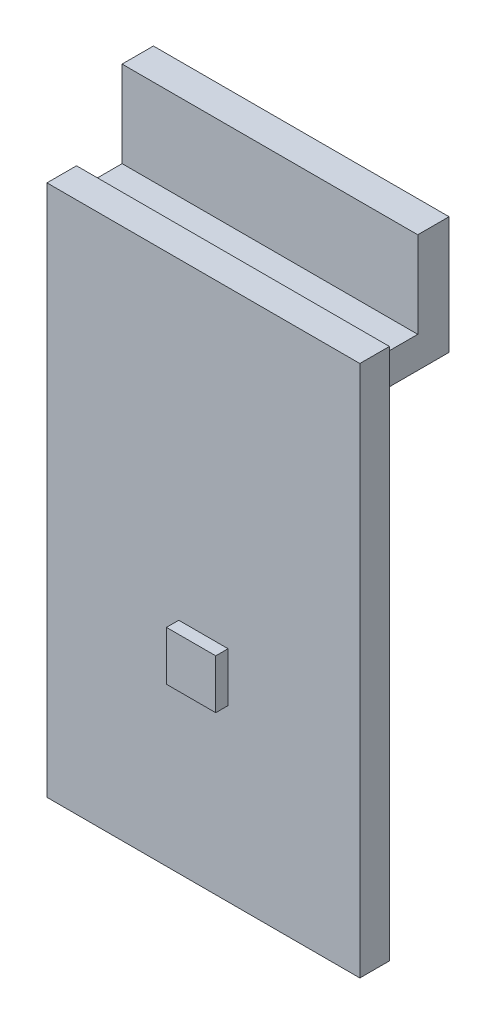
ISO-10303-21;
HEADER;
FILE_DESCRIPTION(('STEP AP214'),'2;1');
FILE_NAME('part.step','',(''),(''),'','','');
FILE_SCHEMA(('AUTOMOTIVE_DESIGN { 1 0 10303 214 1 1 1 1 }'));
ENDSEC;
DATA;
#1=APPLICATION_CONTEXT('core data for automotive mechanical design processes');
#2=APPLICATION_PROTOCOL_DEFINITION('international standard','automotive_design',2000,#1);
#3=PRODUCT_CONTEXT('',#1,'mechanical');
#4=PRODUCT('Part','Part','',(#3));
#5=PRODUCT_RELATED_PRODUCT_CATEGORY('part','',(#4));
#6=PRODUCT_DEFINITION_FORMATION('','',#4);
#7=PRODUCT_DEFINITION_CONTEXT('part definition',#1,'design');
#8=PRODUCT_DEFINITION('design','',#6,#7);
#9=PRODUCT_DEFINITION_SHAPE('','',#8);
#10=(LENGTH_UNIT() NAMED_UNIT(*) SI_UNIT(.MILLI.,.METRE.));
#11=(NAMED_UNIT(*) PLANE_ANGLE_UNIT() SI_UNIT($,.RADIAN.));
#12=(NAMED_UNIT(*) SI_UNIT($,.STERADIAN.) SOLID_ANGLE_UNIT());
#13=UNCERTAINTY_MEASURE_WITH_UNIT(LENGTH_MEASURE(1.E-05),#10,'distance_accuracy_value','');
#14=(GEOMETRIC_REPRESENTATION_CONTEXT(3) GLOBAL_UNCERTAINTY_ASSIGNED_CONTEXT((#13)) GLOBAL_UNIT_ASSIGNED_CONTEXT((#10,
#11,#12)) REPRESENTATION_CONTEXT('',''));
#15=CARTESIAN_POINT('',(0.,0.,0.));
#16=DIRECTION('',(0.,0.,1.));
#17=DIRECTION('',(1.,0.,0.));
#18=AXIS2_PLACEMENT_3D('',#15,#16,#17);
#19=CARTESIAN_POINT('',(0.,0.,0.));
#20=DIRECTION('',(0.,0.,1.));
#21=DIRECTION('',(1.,0.,0.));
#22=AXIS2_PLACEMENT_3D('',#19,#20,#21);
#23=PLANE('',#22);
#24=DIRECTION('',(0.,1.,0.));
#25=VECTOR('',#24,1.);
#26=CARTESIAN_POINT('',(6.35,10.8,0.));
#27=LINE('',#26,#25);
#28=CARTESIAN_POINT('',(6.35,-10.8,0.));
#29=VERTEX_POINT('',#28);
#30=CARTESIAN_POINT('',(6.35,10.8,0.));
#31=VERTEX_POINT('',#30);
#32=EDGE_CURVE('E187',#29,#31,#27,.T.);
#33=ORIENTED_EDGE('',*,*,#32,.F.);
#34=DIRECTION('',(1.,0.,0.));
#35=VECTOR('',#34,1.);
#36=CARTESIAN_POINT('',(-6.35,-10.8,0.));
#37=LINE('',#36,#35);
#38=CARTESIAN_POINT('',(-6.35,-10.8,0.));
#39=VERTEX_POINT('',#38);
#40=EDGE_CURVE('E192',#39,#29,#37,.T.);
#41=ORIENTED_EDGE('',*,*,#40,.F.);
#42=DIRECTION('',(0.,-1.,0.));
#43=VECTOR('',#42,1.);
#44=CARTESIAN_POINT('',(-6.35,10.8,0.));
#45=LINE('',#44,#43);
#46=CARTESIAN_POINT('',(-6.35,10.8,0.));
#47=VERTEX_POINT('',#46);
#48=EDGE_CURVE('E203',#47,#39,#45,.T.);
#49=ORIENTED_EDGE('',*,*,#48,.F.);
#50=DIRECTION('',(-1.,0.,0.));
#51=VECTOR('',#50,1.);
#52=CARTESIAN_POINT('',(-6.35,10.8,0.));
#53=LINE('',#52,#51);
#54=EDGE_CURVE('E201',#31,#47,#53,.T.);
#55=ORIENTED_EDGE('',*,*,#54,.F.);
#56=EDGE_LOOP('',(#33,#41,#49,#55));
#57=FACE_BOUND('',#56,.T.);
#58=DIRECTION('',(0.,-1.,0.));
#59=VECTOR('',#58,1.);
#60=CARTESIAN_POINT('',(6.,9.03,0.));
#61=LINE('',#60,#59);
#62=CARTESIAN_POINT('',(6.,10.3,0.));
#63=VERTEX_POINT('',#62);
#64=CARTESIAN_POINT('',(6.,9.03,0.));
#65=VERTEX_POINT('',#64);
#66=EDGE_CURVE('E141',#63,#65,#61,.T.);
#67=ORIENTED_EDGE('',*,*,#66,.F.);
#68=DIRECTION('',(-1.,0.,0.));
#69=VECTOR('',#68,1.);
#70=CARTESIAN_POINT('',(6.,10.3,0.));
#71=LINE('',#70,#69);
#72=CARTESIAN_POINT('',(-6.,10.3,0.));
#73=VERTEX_POINT('',#72);
#74=EDGE_CURVE('E398',#63,#73,#71,.T.);
#75=ORIENTED_EDGE('',*,*,#74,.T.);
#76=DIRECTION('',(0.,-1.,0.));
#77=VECTOR('',#76,1.);
#78=CARTESIAN_POINT('',(-6.,9.03,0.));
#79=LINE('',#78,#77);
#80=CARTESIAN_POINT('',(-6.,9.03,0.));
#81=VERTEX_POINT('',#80);
#82=EDGE_CURVE('E154',#73,#81,#79,.T.);
#83=ORIENTED_EDGE('',*,*,#82,.T.);
#84=DIRECTION('',(-1.,0.,0.));
#85=VECTOR('',#84,1.);
#86=CARTESIAN_POINT('',(6.,9.03,0.));
#87=LINE('',#86,#85);
#88=EDGE_CURVE('E48',#65,#81,#87,.T.);
#89=ORIENTED_EDGE('',*,*,#88,.F.);
#90=EDGE_LOOP('',(#67,#75,#83,#89));
#91=FACE_BOUND('',#90,.T.);
#92=ADVANCED_FACE('F33',(#57,#91),#23,.F.);
#93=CARTESIAN_POINT('',(0.,0.,1.2));
#94=DIRECTION('',(0.,0.,1.));
#95=DIRECTION('',(1.,0.,0.));
#96=AXIS2_PLACEMENT_3D('',#93,#94,#95);
#97=PLANE('',#96);
#98=DIRECTION('',(0.,1.,0.));
#99=VECTOR('',#98,1.);
#100=CARTESIAN_POINT('',(6.35,10.8,1.2));
#101=LINE('',#100,#99);
#102=CARTESIAN_POINT('',(6.35,-10.8,1.2));
#103=VERTEX_POINT('',#102);
#104=CARTESIAN_POINT('',(6.35,10.8,1.2));
#105=VERTEX_POINT('',#104);
#106=EDGE_CURVE('E188',#103,#105,#101,.T.);
#107=ORIENTED_EDGE('',*,*,#106,.T.);
#108=DIRECTION('',(-1.,0.,0.));
#109=VECTOR('',#108,1.);
#110=CARTESIAN_POINT('',(-6.35,10.8,1.2));
#111=LINE('',#110,#109);
#112=CARTESIAN_POINT('',(-6.35,10.8,1.2));
#113=VERTEX_POINT('',#112);
#114=EDGE_CURVE('E191',#105,#113,#111,.T.);
#115=ORIENTED_EDGE('',*,*,#114,.T.);
#116=DIRECTION('',(0.,-1.,0.));
#117=VECTOR('',#116,1.);
#118=CARTESIAN_POINT('',(-6.35,10.8,1.2));
#119=LINE('',#118,#117);
#120=CARTESIAN_POINT('',(-6.35,-10.8,1.2));
#121=VERTEX_POINT('',#120);
#122=EDGE_CURVE('E194',#113,#121,#119,.T.);
#123=ORIENTED_EDGE('',*,*,#122,.T.);
#124=DIRECTION('',(1.,0.,0.));
#125=VECTOR('',#124,1.);
#126=CARTESIAN_POINT('',(-6.35,-10.8,1.2));
#127=LINE('',#126,#125);
#128=EDGE_CURVE('E196',#121,#103,#127,.T.);
#129=ORIENTED_EDGE('',*,*,#128,.T.);
#130=EDGE_LOOP('',(#107,#115,#123,#129));
#131=FACE_BOUND('',#130,.T.);
#132=DIRECTION('',(-1.,0.,0.));
#133=VECTOR('',#132,1.);
#134=CARTESIAN_POINT('',(-1.,-1.9,1.2));
#135=LINE('',#134,#133);
#136=CARTESIAN_POINT('',(1.,-1.9,1.2));
#137=VERTEX_POINT('',#136);
#138=CARTESIAN_POINT('',(-1.,-1.9,1.2));
#139=VERTEX_POINT('',#138);
#140=EDGE_CURVE('E158',#137,#139,#135,.T.);
#141=ORIENTED_EDGE('',*,*,#140,.F.);
#142=DIRECTION('',(0.,1.,0.));
#143=VECTOR('',#142,1.);
#144=CARTESIAN_POINT('',(1.,-1.9,1.2));
#145=LINE('',#144,#143);
#146=CARTESIAN_POINT('',(1.,-3.9,1.2));
#147=VERTEX_POINT('',#146);
#148=EDGE_CURVE('E155',#147,#137,#145,.T.);
#149=ORIENTED_EDGE('',*,*,#148,.F.);
#150=DIRECTION('',(1.,0.,0.));
#151=VECTOR('',#150,1.);
#152=CARTESIAN_POINT('',(-1.,-3.9,1.2));
#153=LINE('',#152,#151);
#154=CARTESIAN_POINT('',(-1.,-3.9,1.2));
#155=VERTEX_POINT('',#154);
#156=EDGE_CURVE('E168',#155,#147,#153,.T.);
#157=ORIENTED_EDGE('',*,*,#156,.F.);
#158=DIRECTION('',(0.,-1.,0.));
#159=VECTOR('',#158,1.);
#160=CARTESIAN_POINT('',(-1.,-1.9,1.2));
#161=LINE('',#160,#159);
#162=EDGE_CURVE('E176',#139,#155,#161,.T.);
#163=ORIENTED_EDGE('',*,*,#162,.F.);
#164=EDGE_LOOP('',(#141,#149,#157,#163));
#165=FACE_BOUND('',#164,.T.);
#166=ADVANCED_FACE('F229',(#131,#165),#97,.T.);
#167=CARTESIAN_POINT('',(6.35,10.8,1.2));
#168=DIRECTION('',(-1.,0.,0.));
#169=DIRECTION('',(0.,0.,1.));
#170=AXIS2_PLACEMENT_3D('',#167,#168,#169);
#171=PLANE('',#170);
#172=ORIENTED_EDGE('',*,*,#32,.T.);
#173=DIRECTION('',(0.,0.,-1.));
#174=VECTOR('',#173,1.);
#175=CARTESIAN_POINT('',(6.35,10.8,1.2));
#176=LINE('',#175,#174);
#177=EDGE_CURVE('E11',#105,#31,#176,.T.);
#178=ORIENTED_EDGE('',*,*,#177,.F.);
#179=ORIENTED_EDGE('',*,*,#106,.F.);
#180=DIRECTION('',(0.,0.,-1.));
#181=VECTOR('',#180,1.);
#182=CARTESIAN_POINT('',(6.35,-10.8,1.2));
#183=LINE('',#182,#181);
#184=EDGE_CURVE('E198',#103,#29,#183,.T.);
#185=ORIENTED_EDGE('',*,*,#184,.T.);
#186=EDGE_LOOP('',(#172,#178,#179,#185));
#187=FACE_BOUND('',#186,.T.);
#188=ADVANCED_FACE('F35',(#187),#171,.F.);
#189=CARTESIAN_POINT('',(-6.35,10.8,1.2));
#190=DIRECTION('',(0.,-1.,0.));
#191=DIRECTION('',(0.,0.,-1.));
#192=AXIS2_PLACEMENT_3D('',#189,#190,#191);
#193=PLANE('',#192);
#194=ORIENTED_EDGE('',*,*,#54,.T.);
#195=DIRECTION('',(0.,0.,-1.));
#196=VECTOR('',#195,1.);
#197=CARTESIAN_POINT('',(-6.35,10.8,1.2));
#198=LINE('',#197,#196);
#199=EDGE_CURVE('E41',#113,#47,#198,.T.);
#200=ORIENTED_EDGE('',*,*,#199,.F.);
#201=ORIENTED_EDGE('',*,*,#114,.F.);
#202=ORIENTED_EDGE('',*,*,#177,.T.);
#203=EDGE_LOOP('',(#194,#200,#201,#202));
#204=FACE_BOUND('',#203,.T.);
#205=ADVANCED_FACE('F231',(#204),#193,.F.);
#206=CARTESIAN_POINT('',(-6.35,10.8,1.2));
#207=DIRECTION('',(1.,0.,0.));
#208=DIRECTION('',(0.,1.,0.));
#209=AXIS2_PLACEMENT_3D('',#206,#207,#208);
#210=PLANE('',#209);
#211=ORIENTED_EDGE('',*,*,#48,.T.);
#212=DIRECTION('',(0.,0.,-1.));
#213=VECTOR('',#212,1.);
#214=CARTESIAN_POINT('',(-6.35,-10.8,1.2));
#215=LINE('',#214,#213);
#216=EDGE_CURVE('E208',#121,#39,#215,.T.);
#217=ORIENTED_EDGE('',*,*,#216,.F.);
#218=ORIENTED_EDGE('',*,*,#122,.F.);
#219=ORIENTED_EDGE('',*,*,#199,.T.);
#220=EDGE_LOOP('',(#211,#217,#218,#219));
#221=FACE_BOUND('',#220,.T.);
#222=ADVANCED_FACE('F215',(#221),#210,.F.);
#223=CARTESIAN_POINT('',(-6.35,-10.8,1.2));
#224=DIRECTION('',(0.,1.,0.));
#225=DIRECTION('',(0.,0.,1.));
#226=AXIS2_PLACEMENT_3D('',#223,#224,#225);
#227=PLANE('',#226);
#228=ORIENTED_EDGE('',*,*,#40,.T.);
#229=ORIENTED_EDGE('',*,*,#184,.F.);
#230=ORIENTED_EDGE('',*,*,#128,.F.);
#231=ORIENTED_EDGE('',*,*,#216,.T.);
#232=EDGE_LOOP('',(#228,#229,#230,#231));
#233=FACE_BOUND('',#232,.T.);
#234=ADVANCED_FACE('F223',(#233),#227,.F.);
#235=CARTESIAN_POINT('',(1.,-1.9,1.7));
#236=DIRECTION('',(-1.,0.,0.));
#237=DIRECTION('',(0.,-1.,0.));
#238=AXIS2_PLACEMENT_3D('',#235,#236,#237);
#239=PLANE('',#238);
#240=ORIENTED_EDGE('',*,*,#148,.T.);
#241=DIRECTION('',(0.,0.,-1.));
#242=VECTOR('',#241,1.);
#243=CARTESIAN_POINT('',(1.,-1.9,1.7));
#244=LINE('',#243,#242);
#245=CARTESIAN_POINT('',(1.,-1.9,1.7));
#246=VERTEX_POINT('',#245);
#247=EDGE_CURVE('E185',#246,#137,#244,.T.);
#248=ORIENTED_EDGE('',*,*,#247,.F.);
#249=DIRECTION('',(0.,1.,0.));
#250=VECTOR('',#249,1.);
#251=CARTESIAN_POINT('',(1.,-1.9,1.7));
#252=LINE('',#251,#250);
#253=CARTESIAN_POINT('',(1.,-3.9,1.7));
#254=VERTEX_POINT('',#253);
#255=EDGE_CURVE('E164',#254,#246,#252,.T.);
#256=ORIENTED_EDGE('',*,*,#255,.F.);
#257=DIRECTION('',(0.,0.,-1.));
#258=VECTOR('',#257,1.);
#259=CARTESIAN_POINT('',(1.,-3.9,1.7));
#260=LINE('',#259,#258);
#261=EDGE_CURVE('E173',#254,#147,#260,.T.);
#262=ORIENTED_EDGE('',*,*,#261,.T.);
#263=EDGE_LOOP('',(#240,#248,#256,#262));
#264=FACE_BOUND('',#263,.T.);
#265=ADVANCED_FACE('F249',(#264),#239,.F.);
#266=CARTESIAN_POINT('',(-1.,-1.9,1.7));
#267=DIRECTION('',(0.,-1.,0.));
#268=DIRECTION('',(0.,0.,-1.));
#269=AXIS2_PLACEMENT_3D('',#266,#267,#268);
#270=PLANE('',#269);
#271=ORIENTED_EDGE('',*,*,#140,.T.);
#272=DIRECTION('',(0.,0.,-1.));
#273=VECTOR('',#272,1.);
#274=CARTESIAN_POINT('',(-1.,-1.9,1.7));
#275=LINE('',#274,#273);
#276=CARTESIAN_POINT('',(-1.,-1.9,1.7));
#277=VERTEX_POINT('',#276);
#278=EDGE_CURVE('E182',#277,#139,#275,.T.);
#279=ORIENTED_EDGE('',*,*,#278,.F.);
#280=DIRECTION('',(-1.,0.,0.));
#281=VECTOR('',#280,1.);
#282=CARTESIAN_POINT('',(-1.,-1.9,1.7));
#283=LINE('',#282,#281);
#284=EDGE_CURVE('E167',#246,#277,#283,.T.);
#285=ORIENTED_EDGE('',*,*,#284,.F.);
#286=ORIENTED_EDGE('',*,*,#247,.T.);
#287=EDGE_LOOP('',(#271,#279,#285,#286));
#288=FACE_BOUND('',#287,.T.);
#289=ADVANCED_FACE('F253',(#288),#270,.F.);
#290=CARTESIAN_POINT('',(-1.,-1.9,1.7));
#291=DIRECTION('',(1.,0.,0.));
#292=DIRECTION('',(0.,1.,0.));
#293=AXIS2_PLACEMENT_3D('',#290,#291,#292);
#294=PLANE('',#293);
#295=ORIENTED_EDGE('',*,*,#162,.T.);
#296=DIRECTION('',(0.,0.,-1.));
#297=VECTOR('',#296,1.);
#298=CARTESIAN_POINT('',(-1.,-3.9,1.7));
#299=LINE('',#298,#297);
#300=CARTESIAN_POINT('',(-1.,-3.9,1.7));
#301=VERTEX_POINT('',#300);
#302=EDGE_CURVE('E56',#301,#155,#299,.T.);
#303=ORIENTED_EDGE('',*,*,#302,.F.);
#304=DIRECTION('',(0.,-1.,0.));
#305=VECTOR('',#304,1.);
#306=CARTESIAN_POINT('',(-1.,-1.9,1.7));
#307=LINE('',#306,#305);
#308=EDGE_CURVE('E170',#277,#301,#307,.T.);
#309=ORIENTED_EDGE('',*,*,#308,.F.);
#310=ORIENTED_EDGE('',*,*,#278,.T.);
#311=EDGE_LOOP('',(#295,#303,#309,#310));
#312=FACE_BOUND('',#311,.T.);
#313=ADVANCED_FACE('F258',(#312),#294,.F.);
#314=CARTESIAN_POINT('',(-1.,-3.9,1.7));
#315=DIRECTION('',(0.,1.,0.));
#316=DIRECTION('',(0.,0.,1.));
#317=AXIS2_PLACEMENT_3D('',#314,#315,#316);
#318=PLANE('',#317);
#319=ORIENTED_EDGE('',*,*,#156,.T.);
#320=ORIENTED_EDGE('',*,*,#261,.F.);
#321=DIRECTION('',(1.,0.,0.));
#322=VECTOR('',#321,1.);
#323=CARTESIAN_POINT('',(-1.,-3.9,1.7));
#324=LINE('',#323,#322);
#325=EDGE_CURVE('E172',#301,#254,#324,.T.);
#326=ORIENTED_EDGE('',*,*,#325,.F.);
#327=ORIENTED_EDGE('',*,*,#302,.T.);
#328=EDGE_LOOP('',(#319,#320,#326,#327));
#329=FACE_BOUND('',#328,.T.);
#330=ADVANCED_FACE('F264',(#329),#318,.F.);
#331=CARTESIAN_POINT('',(0.,0.,1.7));
#332=DIRECTION('',(0.,0.,1.));
#333=DIRECTION('',(1.,0.,0.));
#334=AXIS2_PLACEMENT_3D('',#331,#332,#333);
#335=PLANE('',#334);
#336=ORIENTED_EDGE('',*,*,#255,.T.);
#337=ORIENTED_EDGE('',*,*,#284,.T.);
#338=ORIENTED_EDGE('',*,*,#308,.T.);
#339=ORIENTED_EDGE('',*,*,#325,.T.);
#340=EDGE_LOOP('',(#336,#337,#338,#339));
#341=FACE_BOUND('',#340,.T.);
#342=ADVANCED_FACE('F268',(#341),#335,.T.);
#343=CARTESIAN_POINT('',(6.,9.03,-2.77));
#344=DIRECTION('',(0.,1.,0.));
#345=DIRECTION('',(0.,0.,1.));
#346=AXIS2_PLACEMENT_3D('',#343,#344,#345);
#347=PLANE('',#346);
#348=DIRECTION('',(0.,0.,-1.));
#349=VECTOR('',#348,1.);
#350=CARTESIAN_POINT('',(-6.,9.03,-2.77));
#351=LINE('',#350,#349);
#352=CARTESIAN_POINT('',(-6.,9.03,-2.77));
#353=VERTEX_POINT('',#352);
#354=EDGE_CURVE('E396',#81,#353,#351,.T.);
#355=ORIENTED_EDGE('',*,*,#354,.T.);
#356=DIRECTION('',(-1.,0.,0.));
#357=VECTOR('',#356,1.);
#358=CARTESIAN_POINT('',(6.,9.03,-2.77));
#359=LINE('',#358,#357);
#360=CARTESIAN_POINT('',(6.,9.03,-2.77));
#361=VERTEX_POINT('',#360);
#362=EDGE_CURVE('E137',#361,#353,#359,.T.);
#363=ORIENTED_EDGE('',*,*,#362,.F.);
#364=DIRECTION('',(0.,0.,-1.));
#365=VECTOR('',#364,1.);
#366=CARTESIAN_POINT('',(6.,9.03,-2.77));
#367=LINE('',#366,#365);
#368=EDGE_CURVE('E133',#65,#361,#367,.T.);
#369=ORIENTED_EDGE('',*,*,#368,.F.);
#370=ORIENTED_EDGE('',*,*,#88,.T.);
#371=EDGE_LOOP('',(#355,#363,#369,#370));
#372=FACE_BOUND('',#371,.T.);
#373=ADVANCED_FACE('F135',(#372),#347,.F.);
#374=CARTESIAN_POINT('',(6.,13.8,-2.77));
#375=DIRECTION('',(0.,0.,1.));
#376=DIRECTION('',(0.,-1.,0.));
#377=AXIS2_PLACEMENT_3D('',#374,#375,#376);
#378=PLANE('',#377);
#379=DIRECTION('',(0.,1.,0.));
#380=VECTOR('',#379,1.);
#381=CARTESIAN_POINT('',(-6.,13.8,-2.77));
#382=LINE('',#381,#380);
#383=CARTESIAN_POINT('',(-6.,13.8,-2.77));
#384=VERTEX_POINT('',#383);
#385=EDGE_CURVE('E417',#353,#384,#382,.T.);
#386=ORIENTED_EDGE('',*,*,#385,.T.);
#387=DIRECTION('',(-1.,0.,0.));
#388=VECTOR('',#387,1.);
#389=CARTESIAN_POINT('',(6.,13.8,-2.77));
#390=LINE('',#389,#388);
#391=CARTESIAN_POINT('',(6.,13.8,-2.77));
#392=VERTEX_POINT('',#391);
#393=EDGE_CURVE('E160',#392,#384,#390,.T.);
#394=ORIENTED_EDGE('',*,*,#393,.F.);
#395=DIRECTION('',(0.,1.,0.));
#396=VECTOR('',#395,1.);
#397=CARTESIAN_POINT('',(6.,13.8,-2.77));
#398=LINE('',#397,#396);
#399=EDGE_CURVE('E140',#361,#392,#398,.T.);
#400=ORIENTED_EDGE('',*,*,#399,.F.);
#401=ORIENTED_EDGE('',*,*,#362,.T.);
#402=EDGE_LOOP('',(#386,#394,#400,#401));
#403=FACE_BOUND('',#402,.T.);
#404=ADVANCED_FACE('F274',(#403),#378,.F.);
#405=CARTESIAN_POINT('',(6.,13.8,-1.5));
#406=DIRECTION('',(0.,-1.,0.));
#407=DIRECTION('',(0.,0.,-1.));
#408=AXIS2_PLACEMENT_3D('',#405,#406,#407);
#409=PLANE('',#408);
#410=DIRECTION('',(0.,0.,1.));
#411=VECTOR('',#410,1.);
#412=CARTESIAN_POINT('',(-6.,13.8,-1.5));
#413=LINE('',#412,#411);
#414=CARTESIAN_POINT('',(-6.,13.8,-1.5));
#415=VERTEX_POINT('',#414);
#416=EDGE_CURVE('E415',#384,#415,#413,.T.);
#417=ORIENTED_EDGE('',*,*,#416,.T.);
#418=DIRECTION('',(-1.,0.,0.));
#419=VECTOR('',#418,1.);
#420=CARTESIAN_POINT('',(6.,13.8,-1.5));
#421=LINE('',#420,#419);
#422=CARTESIAN_POINT('',(6.,13.8,-1.5));
#423=VERTEX_POINT('',#422);
#424=EDGE_CURVE('E402',#423,#415,#421,.T.);
#425=ORIENTED_EDGE('',*,*,#424,.F.);
#426=DIRECTION('',(0.,0.,1.));
#427=VECTOR('',#426,1.);
#428=CARTESIAN_POINT('',(6.,13.8,-1.5));
#429=LINE('',#428,#427);
#430=EDGE_CURVE('E416',#392,#423,#429,.T.);
#431=ORIENTED_EDGE('',*,*,#430,.F.);
#432=ORIENTED_EDGE('',*,*,#393,.T.);
#433=EDGE_LOOP('',(#417,#425,#431,#432));
#434=FACE_BOUND('',#433,.T.);
#435=ADVANCED_FACE('F277',(#434),#409,.F.);
#436=CARTESIAN_POINT('',(6.,10.3,-1.5));
#437=DIRECTION('',(0.,0.,-1.));
#438=DIRECTION('',(-1.,0.,0.));
#439=AXIS2_PLACEMENT_3D('',#436,#437,#438);
#440=PLANE('',#439);
#441=DIRECTION('',(0.,-1.,0.));
#442=VECTOR('',#441,1.);
#443=CARTESIAN_POINT('',(-6.,10.3,-1.5));
#444=LINE('',#443,#442);
#445=CARTESIAN_POINT('',(-6.,10.3,-1.5));
#446=VERTEX_POINT('',#445);
#447=EDGE_CURVE('E418',#415,#446,#444,.T.);
#448=ORIENTED_EDGE('',*,*,#447,.T.);
#449=DIRECTION('',(-1.,0.,0.));
#450=VECTOR('',#449,1.);
#451=CARTESIAN_POINT('',(6.,10.3,-1.5));
#452=LINE('',#451,#450);
#453=CARTESIAN_POINT('',(6.,10.3,-1.5));
#454=VERTEX_POINT('',#453);
#455=EDGE_CURVE('E399',#454,#446,#452,.T.);
#456=ORIENTED_EDGE('',*,*,#455,.F.);
#457=DIRECTION('',(0.,-1.,0.));
#458=VECTOR('',#457,1.);
#459=CARTESIAN_POINT('',(6.,10.3,-1.5));
#460=LINE('',#459,#458);
#461=EDGE_CURVE('E404',#423,#454,#460,.T.);
#462=ORIENTED_EDGE('',*,*,#461,.F.);
#463=ORIENTED_EDGE('',*,*,#424,.T.);
#464=EDGE_LOOP('',(#448,#456,#462,#463));
#465=FACE_BOUND('',#464,.T.);
#466=ADVANCED_FACE('F281',(#465),#440,.F.);
#467=CARTESIAN_POINT('',(6.,10.3,0.));
#468=DIRECTION('',(0.,-1.,0.));
#469=DIRECTION('',(0.,0.,-1.));
#470=AXIS2_PLACEMENT_3D('',#467,#468,#469);
#471=PLANE('',#470);
#472=DIRECTION('',(0.,0.,1.));
#473=VECTOR('',#472,1.);
#474=CARTESIAN_POINT('',(-6.,10.3,0.));
#475=LINE('',#474,#473);
#476=EDGE_CURVE('E150',#446,#73,#475,.T.);
#477=ORIENTED_EDGE('',*,*,#476,.T.);
#478=ORIENTED_EDGE('',*,*,#74,.F.);
#479=DIRECTION('',(0.,0.,1.));
#480=VECTOR('',#479,1.);
#481=CARTESIAN_POINT('',(6.,10.3,0.));
#482=LINE('',#481,#480);
#483=EDGE_CURVE('E146',#454,#63,#482,.T.);
#484=ORIENTED_EDGE('',*,*,#483,.F.);
#485=ORIENTED_EDGE('',*,*,#455,.T.);
#486=EDGE_LOOP('',(#477,#478,#484,#485));
#487=FACE_BOUND('',#486,.T.);
#488=ADVANCED_FACE('F285',(#487),#471,.F.);
#489=CARTESIAN_POINT('',(6.,0.,0.));
#490=DIRECTION('',(-1.,0.,0.));
#491=DIRECTION('',(0.,0.,1.));
#492=AXIS2_PLACEMENT_3D('',#489,#490,#491);
#493=PLANE('',#492);
#494=ORIENTED_EDGE('',*,*,#66,.T.);
#495=ORIENTED_EDGE('',*,*,#368,.T.);
#496=ORIENTED_EDGE('',*,*,#399,.T.);
#497=ORIENTED_EDGE('',*,*,#430,.T.);
#498=ORIENTED_EDGE('',*,*,#461,.T.);
#499=ORIENTED_EDGE('',*,*,#483,.T.);
#500=EDGE_LOOP('',(#494,#495,#496,#497,#498,#499));
#501=FACE_BOUND('',#500,.T.);
#502=ADVANCED_FACE('F144',(#501),#493,.F.);
#503=CARTESIAN_POINT('',(-6.,0.,0.));
#504=DIRECTION('',(-1.,0.,0.));
#505=DIRECTION('',(0.,0.,1.));
#506=AXIS2_PLACEMENT_3D('',#503,#504,#505);
#507=PLANE('',#506);
#508=ORIENTED_EDGE('',*,*,#82,.F.);
#509=ORIENTED_EDGE('',*,*,#476,.F.);
#510=ORIENTED_EDGE('',*,*,#447,.F.);
#511=ORIENTED_EDGE('',*,*,#416,.F.);
#512=ORIENTED_EDGE('',*,*,#385,.F.);
#513=ORIENTED_EDGE('',*,*,#354,.F.);
#514=EDGE_LOOP('',(#508,#509,#510,#511,#512,#513));
#515=FACE_BOUND('',#514,.T.);
#516=ADVANCED_FACE('F290',(#515),#507,.T.);
#517=CLOSED_SHELL('',(#92,#166,#188,#205,#222,#234,#265,#289,#313,#330,#342,#373,#404,#435,#466,
#488,#502,#516));
#518=MANIFOLD_SOLID_BREP('B2',#517);
#519=ADVANCED_BREP_SHAPE_REPRESENTATION('',(#18,#518),#14);
#520=SHAPE_DEFINITION_REPRESENTATION(#9,#519);
ENDSEC;
END-ISO-10303-21;
